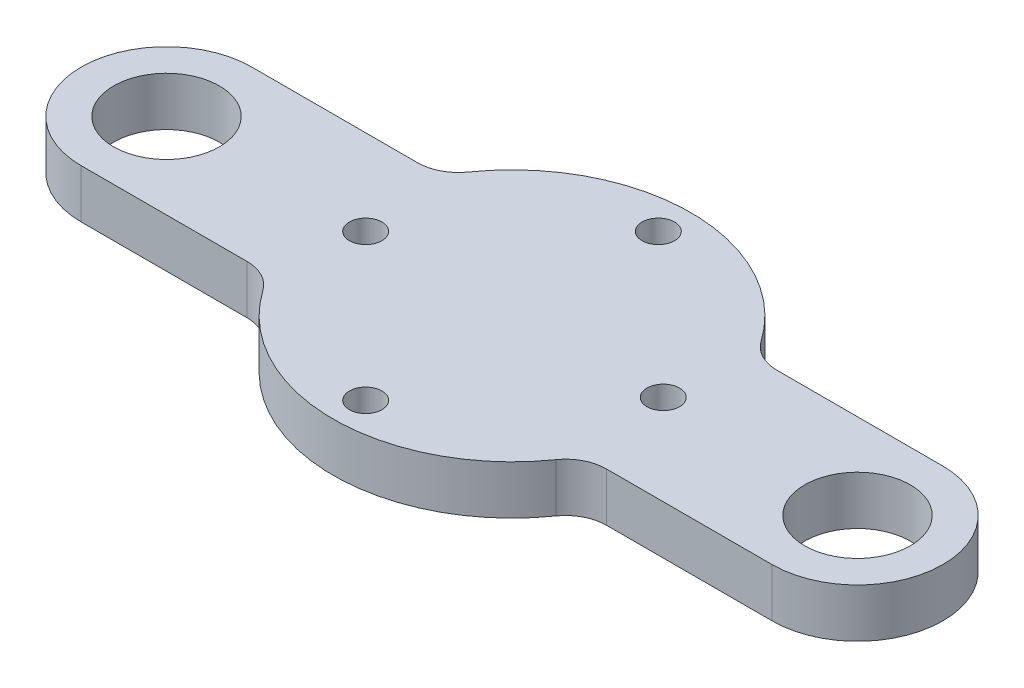
ISO-10303-21;
HEADER;
FILE_DESCRIPTION(('STEP AP214'),'2;1');
FILE_NAME('part.step','',(''),(''),'','','');
FILE_SCHEMA(('AUTOMOTIVE_DESIGN { 1 0 10303 214 1 1 1 1 }'));
ENDSEC;
DATA;
#1=APPLICATION_CONTEXT('core data for automotive mechanical design processes');
#2=APPLICATION_PROTOCOL_DEFINITION('international standard','automotive_design',2000,#1);
#3=PRODUCT_CONTEXT('',#1,'mechanical');
#4=PRODUCT('Part','Part','',(#3));
#5=PRODUCT_RELATED_PRODUCT_CATEGORY('part','',(#4));
#6=PRODUCT_DEFINITION_FORMATION('','',#4);
#7=PRODUCT_DEFINITION_CONTEXT('part definition',#1,'design');
#8=PRODUCT_DEFINITION('design','',#6,#7);
#9=PRODUCT_DEFINITION_SHAPE('','',#8);
#10=(LENGTH_UNIT() NAMED_UNIT(*) SI_UNIT(.MILLI.,.METRE.));
#11=(NAMED_UNIT(*) PLANE_ANGLE_UNIT() SI_UNIT($,.RADIAN.));
#12=(NAMED_UNIT(*) SI_UNIT($,.STERADIAN.) SOLID_ANGLE_UNIT());
#13=UNCERTAINTY_MEASURE_WITH_UNIT(LENGTH_MEASURE(1.E-05),#10,'distance_accuracy_value','');
#14=(GEOMETRIC_REPRESENTATION_CONTEXT(3) GLOBAL_UNCERTAINTY_ASSIGNED_CONTEXT((#13)) GLOBAL_UNIT_ASSIGNED_CONTEXT((#10,
#11,#12)) REPRESENTATION_CONTEXT('',''));
#15=CARTESIAN_POINT('',(0.,0.,0.));
#16=DIRECTION('',(0.,0.,1.));
#17=DIRECTION('',(1.,0.,0.));
#18=AXIS2_PLACEMENT_3D('',#15,#16,#17);
#19=CARTESIAN_POINT('',(0.,6.,10.5));
#20=DIRECTION('',(0.,0.,-1.));
#21=DIRECTION('',(-1.,0.,0.));
#22=AXIS2_PLACEMENT_3D('',#19,#20,#21);
#23=PLANE('',#22);
#24=DIRECTION('',(1.,0.,0.));
#25=VECTOR('',#24,1.);
#26=CARTESIAN_POINT('',(0.,0.,10.5));
#27=LINE('',#26,#25);
#28=CARTESIAN_POINT('',(22.1076909694341,0.,10.5));
#29=VERTEX_POINT('',#28);
#30=CARTESIAN_POINT('',(42.5,0.,10.5));
#31=VERTEX_POINT('',#30);
#32=EDGE_CURVE('E198',#29,#31,#27,.T.);
#33=ORIENTED_EDGE('',*,*,#32,.T.);
#34=DIRECTION('',(0.,-1.,0.));
#35=VECTOR('',#34,1.);
#36=CARTESIAN_POINT('',(42.5,6.,10.5));
#37=LINE('',#36,#35);
#38=CARTESIAN_POINT('',(42.5,6.,10.5));
#39=VERTEX_POINT('',#38);
#40=EDGE_CURVE('E11',#39,#31,#37,.T.);
#41=ORIENTED_EDGE('',*,*,#40,.F.);
#42=DIRECTION('',(1.,0.,0.));
#43=VECTOR('',#42,1.);
#44=CARTESIAN_POINT('',(0.,6.,10.5));
#45=LINE('',#44,#43);
#46=CARTESIAN_POINT('',(22.1076909694341,6.,10.5));
#47=VERTEX_POINT('',#46);
#48=EDGE_CURVE('E265',#47,#39,#45,.T.);
#49=ORIENTED_EDGE('',*,*,#48,.F.);
#50=DIRECTION('',(0.,-1.,0.));
#51=VECTOR('',#50,1.);
#52=CARTESIAN_POINT('',(22.1076909694341,6.,10.5));
#53=LINE('',#52,#51);
#54=EDGE_CURVE('E62',#47,#29,#53,.T.);
#55=ORIENTED_EDGE('',*,*,#54,.T.);
#56=EDGE_LOOP('',(#33,#41,#49,#55));
#57=FACE_BOUND('',#56,.T.);
#58=ADVANCED_FACE('F45',(#57),#23,.F.);
#59=CARTESIAN_POINT('',(42.5,6.,0.));
#60=DIRECTION('',(0.,-1.,0.));
#61=DIRECTION('',(0.,0.,-1.));
#62=AXIS2_PLACEMENT_3D('',#59,#60,#61);
#63=CYLINDRICAL_SURFACE('',#62,10.5);
#64=CARTESIAN_POINT('',(42.5,0.,0.));
#65=DIRECTION('',(0.,1.,0.));
#66=DIRECTION('',(0.,0.,1.));
#67=AXIS2_PLACEMENT_3D('',#64,#65,#66);
#68=CIRCLE('',#67,10.5);
#69=CARTESIAN_POINT('',(42.5,0.,-10.5));
#70=VERTEX_POINT('',#69);
#71=EDGE_CURVE('E201',#31,#70,#68,.T.);
#72=ORIENTED_EDGE('',*,*,#71,.T.);
#73=DIRECTION('',(0.,-1.,0.));
#74=VECTOR('',#73,1.);
#75=CARTESIAN_POINT('',(42.5,6.,-10.5));
#76=LINE('',#75,#74);
#77=CARTESIAN_POINT('',(42.5,6.,-10.5));
#78=VERTEX_POINT('',#77);
#79=EDGE_CURVE('E54',#78,#70,#76,.T.);
#80=ORIENTED_EDGE('',*,*,#79,.F.);
#81=CARTESIAN_POINT('',(42.5,6.,0.));
#82=DIRECTION('',(0.,1.,0.));
#83=DIRECTION('',(0.,0.,1.));
#84=AXIS2_PLACEMENT_3D('',#81,#82,#83);
#85=CIRCLE('',#84,10.5);
#86=EDGE_CURVE('E113',#39,#78,#85,.T.);
#87=ORIENTED_EDGE('',*,*,#86,.F.);
#88=ORIENTED_EDGE('',*,*,#40,.T.);
#89=EDGE_LOOP('',(#72,#80,#87,#88));
#90=FACE_BOUND('',#89,.T.);
#91=ADVANCED_FACE('F297',(#90),#63,.T.);
#92=CARTESIAN_POINT('',(0.,6.,-10.5));
#93=DIRECTION('',(0.,0.,-1.));
#94=DIRECTION('',(-1.,0.,0.));
#95=AXIS2_PLACEMENT_3D('',#92,#93,#94);
#96=PLANE('',#95);
#97=DIRECTION('',(1.,0.,0.));
#98=VECTOR('',#97,1.);
#99=CARTESIAN_POINT('',(0.,0.,-10.5));
#100=LINE('',#99,#98);
#101=CARTESIAN_POINT('',(22.1076909694341,0.,-10.5));
#102=VERTEX_POINT('',#101);
#103=EDGE_CURVE('E205',#102,#70,#100,.T.);
#104=ORIENTED_EDGE('',*,*,#103,.F.);
#105=DIRECTION('',(0.,-1.,0.));
#106=VECTOR('',#105,1.);
#107=CARTESIAN_POINT('',(22.1076909694341,6.,-10.5));
#108=LINE('',#107,#106);
#109=CARTESIAN_POINT('',(22.1076909694341,6.,-10.5));
#110=VERTEX_POINT('',#109);
#111=EDGE_CURVE('E288',#110,#102,#108,.T.);
#112=ORIENTED_EDGE('',*,*,#111,.F.);
#113=DIRECTION('',(1.,0.,0.));
#114=VECTOR('',#113,1.);
#115=CARTESIAN_POINT('',(0.,6.,-10.5));
#116=LINE('',#115,#114);
#117=EDGE_CURVE('E296',#110,#78,#116,.T.);
#118=ORIENTED_EDGE('',*,*,#117,.T.);
#119=ORIENTED_EDGE('',*,*,#79,.T.);
#120=EDGE_LOOP('',(#104,#112,#118,#119));
#121=FACE_BOUND('',#120,.T.);
#122=ADVANCED_FACE('F294',(#121),#96,.T.);
#123=CARTESIAN_POINT('',(22.1076909694341,6.,-15.5));
#124=DIRECTION('',(0.,-1.,0.));
#125=DIRECTION('',(0.,0.,-1.));
#126=AXIS2_PLACEMENT_3D('',#123,#124,#125);
#127=CYLINDRICAL_SURFACE('',#126,5.);
#128=CARTESIAN_POINT('',(22.1076909694341,0.,-15.5));
#129=DIRECTION('',(0.,1.,0.));
#130=DIRECTION('',(0.,0.,1.));
#131=AXIS2_PLACEMENT_3D('',#128,#129,#130);
#132=CIRCLE('',#131,5.);
#133=CARTESIAN_POINT('',(18.0136741232426,0.,-12.6296296296296));
#134=VERTEX_POINT('',#133);
#135=EDGE_CURVE('E209',#134,#102,#132,.T.);
#136=ORIENTED_EDGE('',*,*,#135,.F.);
#137=DIRECTION('',(0.,-1.,0.));
#138=VECTOR('',#137,1.);
#139=CARTESIAN_POINT('',(18.0136741232426,6.,-12.6296296296296));
#140=LINE('',#139,#138);
#141=CARTESIAN_POINT('',(18.0136741232426,6.,-12.6296296296296));
#142=VERTEX_POINT('',#141);
#143=EDGE_CURVE('E285',#142,#134,#140,.T.);
#144=ORIENTED_EDGE('',*,*,#143,.F.);
#145=CARTESIAN_POINT('',(22.1076909694341,6.,-15.5));
#146=DIRECTION('',(0.,1.,0.));
#147=DIRECTION('',(0.,0.,1.));
#148=AXIS2_PLACEMENT_3D('',#145,#146,#147);
#149=CIRCLE('',#148,5.);
#150=EDGE_CURVE('E309',#142,#110,#149,.T.);
#151=ORIENTED_EDGE('',*,*,#150,.T.);
#152=ORIENTED_EDGE('',*,*,#111,.T.);
#153=EDGE_LOOP('',(#136,#144,#151,#152));
#154=FACE_BOUND('',#153,.T.);
#155=ADVANCED_FACE('F305',(#154),#127,.F.);
#156=CARTESIAN_POINT('',(0.,6.,0.));
#157=DIRECTION('',(0.,-1.,0.));
#158=DIRECTION('',(0.,0.,-1.));
#159=AXIS2_PLACEMENT_3D('',#156,#157,#158);
#160=CYLINDRICAL_SURFACE('',#159,22.);
#161=CARTESIAN_POINT('',(0.,0.,0.));
#162=DIRECTION('',(0.,1.,0.));
#163=DIRECTION('',(0.,0.,1.));
#164=AXIS2_PLACEMENT_3D('',#161,#162,#163);
#165=CIRCLE('',#164,22.);
#166=CARTESIAN_POINT('',(-18.0136741232426,0.,-12.6296296296296));
#167=VERTEX_POINT('',#166);
#168=EDGE_CURVE('E213',#134,#167,#165,.T.);
#169=ORIENTED_EDGE('',*,*,#168,.T.);
#170=DIRECTION('',(0.,-1.,0.));
#171=VECTOR('',#170,1.);
#172=CARTESIAN_POINT('',(-18.0136741232426,6.,-12.6296296296296));
#173=LINE('',#172,#171);
#174=CARTESIAN_POINT('',(-18.0136741232426,6.,-12.6296296296296));
#175=VERTEX_POINT('',#174);
#176=EDGE_CURVE('E282',#175,#167,#173,.T.);
#177=ORIENTED_EDGE('',*,*,#176,.F.);
#178=CARTESIAN_POINT('',(0.,6.,0.));
#179=DIRECTION('',(0.,1.,0.));
#180=DIRECTION('',(0.,0.,1.));
#181=AXIS2_PLACEMENT_3D('',#178,#179,#180);
#182=CIRCLE('',#181,22.);
#183=EDGE_CURVE('E314',#142,#175,#182,.T.);
#184=ORIENTED_EDGE('',*,*,#183,.F.);
#185=ORIENTED_EDGE('',*,*,#143,.T.);
#186=EDGE_LOOP('',(#169,#177,#184,#185));
#187=FACE_BOUND('',#186,.T.);
#188=ADVANCED_FACE('F366',(#187),#160,.T.);
#189=CARTESIAN_POINT('',(-22.1076909694341,6.,-15.5));
#190=DIRECTION('',(0.,-1.,0.));
#191=DIRECTION('',(0.,0.,-1.));
#192=AXIS2_PLACEMENT_3D('',#189,#190,#191);
#193=CYLINDRICAL_SURFACE('',#192,5.);
#194=CARTESIAN_POINT('',(-22.1076909694341,0.,-15.5));
#195=DIRECTION('',(0.,1.,0.));
#196=DIRECTION('',(0.,0.,1.));
#197=AXIS2_PLACEMENT_3D('',#194,#195,#196);
#198=CIRCLE('',#197,5.);
#199=CARTESIAN_POINT('',(-22.1076909694341,0.,-10.5));
#200=VERTEX_POINT('',#199);
#201=EDGE_CURVE('E217',#200,#167,#198,.T.);
#202=ORIENTED_EDGE('',*,*,#201,.F.);
#203=DIRECTION('',(0.,-1.,0.));
#204=VECTOR('',#203,1.);
#205=CARTESIAN_POINT('',(-22.1076909694341,6.,-10.5));
#206=LINE('',#205,#204);
#207=CARTESIAN_POINT('',(-22.1076909694341,6.,-10.5));
#208=VERTEX_POINT('',#207);
#209=EDGE_CURVE('E279',#208,#200,#206,.T.);
#210=ORIENTED_EDGE('',*,*,#209,.F.);
#211=CARTESIAN_POINT('',(-22.1076909694341,6.,-15.5));
#212=DIRECTION('',(0.,1.,0.));
#213=DIRECTION('',(0.,0.,1.));
#214=AXIS2_PLACEMENT_3D('',#211,#212,#213);
#215=CIRCLE('',#214,5.);
#216=EDGE_CURVE('E321',#208,#175,#215,.T.);
#217=ORIENTED_EDGE('',*,*,#216,.T.);
#218=ORIENTED_EDGE('',*,*,#176,.T.);
#219=EDGE_LOOP('',(#202,#210,#217,#218));
#220=FACE_BOUND('',#219,.T.);
#221=ADVANCED_FACE('F369',(#220),#193,.F.);
#222=CARTESIAN_POINT('',(0.,6.,-10.5));
#223=DIRECTION('',(0.,0.,-1.));
#224=DIRECTION('',(-1.,0.,0.));
#225=AXIS2_PLACEMENT_3D('',#222,#223,#224);
#226=PLANE('',#225);
#227=DIRECTION('',(1.,0.,0.));
#228=VECTOR('',#227,1.);
#229=CARTESIAN_POINT('',(0.,0.,-10.5));
#230=LINE('',#229,#228);
#231=CARTESIAN_POINT('',(-42.5,0.,-10.5));
#232=VERTEX_POINT('',#231);
#233=EDGE_CURVE('E221',#232,#200,#230,.T.);
#234=ORIENTED_EDGE('',*,*,#233,.F.);
#235=DIRECTION('',(0.,-1.,0.));
#236=VECTOR('',#235,1.);
#237=CARTESIAN_POINT('',(-42.5,6.,-10.5));
#238=LINE('',#237,#236);
#239=CARTESIAN_POINT('',(-42.5,6.,-10.5));
#240=VERTEX_POINT('',#239);
#241=EDGE_CURVE('E276',#240,#232,#238,.T.);
#242=ORIENTED_EDGE('',*,*,#241,.F.);
#243=DIRECTION('',(1.,0.,0.));
#244=VECTOR('',#243,1.);
#245=CARTESIAN_POINT('',(0.,6.,-10.5));
#246=LINE('',#245,#244);
#247=EDGE_CURVE('E325',#240,#208,#246,.T.);
#248=ORIENTED_EDGE('',*,*,#247,.T.);
#249=ORIENTED_EDGE('',*,*,#209,.T.);
#250=EDGE_LOOP('',(#234,#242,#248,#249));
#251=FACE_BOUND('',#250,.T.);
#252=ADVANCED_FACE('F373',(#251),#226,.T.);
#253=CARTESIAN_POINT('',(-42.5,6.,0.));
#254=DIRECTION('',(0.,-1.,0.));
#255=DIRECTION('',(0.,0.,-1.));
#256=AXIS2_PLACEMENT_3D('',#253,#254,#255);
#257=CYLINDRICAL_SURFACE('',#256,10.5);
#258=CARTESIAN_POINT('',(-42.5,0.,0.));
#259=DIRECTION('',(0.,1.,0.));
#260=DIRECTION('',(0.,0.,1.));
#261=AXIS2_PLACEMENT_3D('',#258,#259,#260);
#262=CIRCLE('',#261,10.5);
#263=CARTESIAN_POINT('',(-42.5,0.,10.5));
#264=VERTEX_POINT('',#263);
#265=EDGE_CURVE('E225',#232,#264,#262,.T.);
#266=ORIENTED_EDGE('',*,*,#265,.T.);
#267=DIRECTION('',(0.,-1.,0.));
#268=VECTOR('',#267,1.);
#269=CARTESIAN_POINT('',(-42.5,6.,10.5));
#270=LINE('',#269,#268);
#271=CARTESIAN_POINT('',(-42.5,6.,10.5));
#272=VERTEX_POINT('',#271);
#273=EDGE_CURVE('E272',#272,#264,#270,.T.);
#274=ORIENTED_EDGE('',*,*,#273,.F.);
#275=CARTESIAN_POINT('',(-42.5,6.,0.));
#276=DIRECTION('',(0.,1.,0.));
#277=DIRECTION('',(0.,0.,1.));
#278=AXIS2_PLACEMENT_3D('',#275,#276,#277);
#279=CIRCLE('',#278,10.5);
#280=EDGE_CURVE('E168',#240,#272,#279,.T.);
#281=ORIENTED_EDGE('',*,*,#280,.F.);
#282=ORIENTED_EDGE('',*,*,#241,.T.);
#283=EDGE_LOOP('',(#266,#274,#281,#282));
#284=FACE_BOUND('',#283,.T.);
#285=ADVANCED_FACE('F334',(#284),#257,.T.);
#286=CARTESIAN_POINT('',(0.,6.,10.5));
#287=DIRECTION('',(0.,0.,-1.));
#288=DIRECTION('',(-1.,0.,0.));
#289=AXIS2_PLACEMENT_3D('',#286,#287,#288);
#290=PLANE('',#289);
#291=DIRECTION('',(1.,0.,0.));
#292=VECTOR('',#291,1.);
#293=CARTESIAN_POINT('',(0.,0.,10.5));
#294=LINE('',#293,#292);
#295=CARTESIAN_POINT('',(-22.1076909694341,0.,10.5));
#296=VERTEX_POINT('',#295);
#297=EDGE_CURVE('E228',#264,#296,#294,.T.);
#298=ORIENTED_EDGE('',*,*,#297,.T.);
#299=DIRECTION('',(0.,-1.,0.));
#300=VECTOR('',#299,1.);
#301=CARTESIAN_POINT('',(-22.1076909694341,6.,10.5));
#302=LINE('',#301,#300);
#303=CARTESIAN_POINT('',(-22.1076909694341,6.,10.5));
#304=VERTEX_POINT('',#303);
#305=EDGE_CURVE('E151',#304,#296,#302,.T.);
#306=ORIENTED_EDGE('',*,*,#305,.F.);
#307=DIRECTION('',(1.,0.,0.));
#308=VECTOR('',#307,1.);
#309=CARTESIAN_POINT('',(0.,6.,10.5));
#310=LINE('',#309,#308);
#311=EDGE_CURVE('E163',#272,#304,#310,.T.);
#312=ORIENTED_EDGE('',*,*,#311,.F.);
#313=ORIENTED_EDGE('',*,*,#273,.T.);
#314=EDGE_LOOP('',(#298,#306,#312,#313));
#315=FACE_BOUND('',#314,.T.);
#316=ADVANCED_FACE('F338',(#315),#290,.F.);
#317=CARTESIAN_POINT('',(-22.1076909694341,6.,15.5));
#318=DIRECTION('',(0.,-1.,0.));
#319=DIRECTION('',(0.,0.,-1.));
#320=AXIS2_PLACEMENT_3D('',#317,#318,#319);
#321=CYLINDRICAL_SURFACE('',#320,5.);
#322=CARTESIAN_POINT('',(-22.1076909694341,0.,15.5));
#323=DIRECTION('',(0.,1.,0.));
#324=DIRECTION('',(0.,0.,1.));
#325=AXIS2_PLACEMENT_3D('',#322,#323,#324);
#326=CIRCLE('',#325,5.);
#327=CARTESIAN_POINT('',(-18.0136741232426,0.,12.6296296296296));
#328=VERTEX_POINT('',#327);
#329=EDGE_CURVE('E147',#328,#296,#326,.T.);
#330=ORIENTED_EDGE('',*,*,#329,.F.);
#331=DIRECTION('',(0.,-1.,0.));
#332=VECTOR('',#331,1.);
#333=CARTESIAN_POINT('',(-18.0136741232426,6.,12.6296296296296));
#334=LINE('',#333,#332);
#335=CARTESIAN_POINT('',(-18.0136741232426,6.,12.6296296296296));
#336=VERTEX_POINT('',#335);
#337=EDGE_CURVE('E141',#336,#328,#334,.T.);
#338=ORIENTED_EDGE('',*,*,#337,.F.);
#339=CARTESIAN_POINT('',(-22.1076909694341,6.,15.5));
#340=DIRECTION('',(0.,1.,0.));
#341=DIRECTION('',(0.,0.,1.));
#342=AXIS2_PLACEMENT_3D('',#339,#340,#341);
#343=CIRCLE('',#342,5.);
#344=EDGE_CURVE('E145',#336,#304,#343,.T.);
#345=ORIENTED_EDGE('',*,*,#344,.T.);
#346=ORIENTED_EDGE('',*,*,#305,.T.);
#347=EDGE_LOOP('',(#330,#338,#345,#346));
#348=FACE_BOUND('',#347,.T.);
#349=ADVANCED_FACE('F143',(#348),#321,.F.);
#350=CARTESIAN_POINT('',(0.,6.,0.));
#351=DIRECTION('',(0.,-1.,0.));
#352=DIRECTION('',(0.,0.,-1.));
#353=AXIS2_PLACEMENT_3D('',#350,#351,#352);
#354=CYLINDRICAL_SURFACE('',#353,22.);
#355=CARTESIAN_POINT('',(0.,0.,0.));
#356=DIRECTION('',(0.,1.,0.));
#357=DIRECTION('',(0.,0.,1.));
#358=AXIS2_PLACEMENT_3D('',#355,#356,#357);
#359=CIRCLE('',#358,22.);
#360=CARTESIAN_POINT('',(18.0136741232426,0.,12.6296296296296));
#361=VERTEX_POINT('',#360);
#362=EDGE_CURVE('E234',#328,#361,#359,.T.);
#363=ORIENTED_EDGE('',*,*,#362,.T.);
#364=DIRECTION('',(0.,-1.,0.));
#365=VECTOR('',#364,1.);
#366=CARTESIAN_POINT('',(18.0136741232426,6.,12.6296296296296));
#367=LINE('',#366,#365);
#368=CARTESIAN_POINT('',(18.0136741232426,6.,12.6296296296296));
#369=VERTEX_POINT('',#368);
#370=EDGE_CURVE('E101',#369,#361,#367,.T.);
#371=ORIENTED_EDGE('',*,*,#370,.F.);
#372=CARTESIAN_POINT('',(0.,6.,0.));
#373=DIRECTION('',(0.,1.,0.));
#374=DIRECTION('',(0.,0.,1.));
#375=AXIS2_PLACEMENT_3D('',#372,#373,#374);
#376=CIRCLE('',#375,22.);
#377=EDGE_CURVE('E153',#336,#369,#376,.T.);
#378=ORIENTED_EDGE('',*,*,#377,.F.);
#379=ORIENTED_EDGE('',*,*,#337,.T.);
#380=EDGE_LOOP('',(#363,#371,#378,#379));
#381=FACE_BOUND('',#380,.T.);
#382=ADVANCED_FACE('F154',(#381),#354,.T.);
#383=CARTESIAN_POINT('',(-42.5,6.,0.));
#384=DIRECTION('',(0.,-1.,0.));
#385=DIRECTION('',(0.,0.,-1.));
#386=AXIS2_PLACEMENT_3D('',#383,#384,#385);
#387=CYLINDRICAL_SURFACE('',#386,6.5);
#388=CARTESIAN_POINT('',(-42.5,6.,0.));
#389=DIRECTION('',(0.,1.,0.));
#390=DIRECTION('',(0.,0.,1.));
#391=AXIS2_PLACEMENT_3D('',#388,#389,#390);
#392=CIRCLE('',#391,6.5);
#393=CARTESIAN_POINT('',(-42.5,6.,6.50000000000001));
#394=VERTEX_POINT('',#393);
#395=EDGE_CURVE('E190',#394,#394,#392,.T.);
#396=ORIENTED_EDGE('',*,*,#395,.T.);
#397=EDGE_LOOP('',(#396));
#398=FACE_BOUND('',#397,.T.);
#399=CARTESIAN_POINT('',(-42.5,0.,0.));
#400=DIRECTION('',(0.,1.,0.));
#401=DIRECTION('',(0.,0.,1.));
#402=AXIS2_PLACEMENT_3D('',#399,#400,#401);
#403=CIRCLE('',#402,6.5);
#404=CARTESIAN_POINT('',(-42.5,0.,6.50000000000001));
#405=VERTEX_POINT('',#404);
#406=EDGE_CURVE('E257',#405,#405,#403,.T.);
#407=ORIENTED_EDGE('',*,*,#406,.F.);
#408=EDGE_LOOP('',(#407));
#409=FACE_BOUND('',#408,.T.);
#410=ADVANCED_FACE('F384',(#398,#409),#387,.F.);
#411=CARTESIAN_POINT('',(0.,6.,-18.));
#412=DIRECTION('',(0.,-1.,0.));
#413=DIRECTION('',(0.,0.,-1.));
#414=AXIS2_PLACEMENT_3D('',#411,#412,#413);
#415=CYLINDRICAL_SURFACE('',#414,2.);
#416=CARTESIAN_POINT('',(0.,6.,-18.));
#417=DIRECTION('',(0.,1.,0.));
#418=DIRECTION('',(0.,0.,1.));
#419=AXIS2_PLACEMENT_3D('',#416,#417,#418);
#420=CIRCLE('',#419,2.);
#421=CARTESIAN_POINT('',(0.,6.,-16.));
#422=VERTEX_POINT('',#421);
#423=EDGE_CURVE('E186',#422,#422,#420,.T.);
#424=ORIENTED_EDGE('',*,*,#423,.T.);
#425=EDGE_LOOP('',(#424));
#426=FACE_BOUND('',#425,.T.);
#427=CARTESIAN_POINT('',(0.,0.,-18.));
#428=DIRECTION('',(0.,1.,0.));
#429=DIRECTION('',(0.,0.,1.));
#430=AXIS2_PLACEMENT_3D('',#427,#428,#429);
#431=CIRCLE('',#430,2.);
#432=CARTESIAN_POINT('',(0.,0.,-16.));
#433=VERTEX_POINT('',#432);
#434=EDGE_CURVE('E253',#433,#433,#431,.T.);
#435=ORIENTED_EDGE('',*,*,#434,.F.);
#436=EDGE_LOOP('',(#435));
#437=FACE_BOUND('',#436,.T.);
#438=ADVANCED_FACE('F388',(#426,#437),#415,.F.);
#439=CARTESIAN_POINT('',(-18.,6.,0.));
#440=DIRECTION('',(0.,-1.,0.));
#441=DIRECTION('',(0.,0.,-1.));
#442=AXIS2_PLACEMENT_3D('',#439,#440,#441);
#443=CYLINDRICAL_SURFACE('',#442,2.);
#444=CARTESIAN_POINT('',(-18.,6.,0.));
#445=DIRECTION('',(0.,1.,0.));
#446=DIRECTION('',(0.,0.,1.));
#447=AXIS2_PLACEMENT_3D('',#444,#445,#446);
#448=CIRCLE('',#447,2.);
#449=CARTESIAN_POINT('',(-18.,6.,2.));
#450=VERTEX_POINT('',#449);
#451=EDGE_CURVE('E182',#450,#450,#448,.T.);
#452=ORIENTED_EDGE('',*,*,#451,.T.);
#453=EDGE_LOOP('',(#452));
#454=FACE_BOUND('',#453,.T.);
#455=CARTESIAN_POINT('',(-18.,0.,0.));
#456=DIRECTION('',(0.,1.,0.));
#457=DIRECTION('',(0.,0.,1.));
#458=AXIS2_PLACEMENT_3D('',#455,#456,#457);
#459=CIRCLE('',#458,2.);
#460=CARTESIAN_POINT('',(-18.,0.,2.));
#461=VERTEX_POINT('',#460);
#462=EDGE_CURVE('E249',#461,#461,#459,.T.);
#463=ORIENTED_EDGE('',*,*,#462,.F.);
#464=EDGE_LOOP('',(#463));
#465=FACE_BOUND('',#464,.T.);
#466=ADVANCED_FACE('F394',(#454,#465),#443,.F.);
#467=CARTESIAN_POINT('',(0.,6.,18.));
#468=DIRECTION('',(0.,-1.,0.));
#469=DIRECTION('',(0.,0.,-1.));
#470=AXIS2_PLACEMENT_3D('',#467,#468,#469);
#471=CYLINDRICAL_SURFACE('',#470,2.);
#472=CARTESIAN_POINT('',(0.,6.,18.));
#473=DIRECTION('',(0.,1.,0.));
#474=DIRECTION('',(0.,0.,1.));
#475=AXIS2_PLACEMENT_3D('',#472,#473,#474);
#476=CIRCLE('',#475,2.);
#477=CARTESIAN_POINT('',(0.,6.,20.));
#478=VERTEX_POINT('',#477);
#479=EDGE_CURVE('E178',#478,#478,#476,.T.);
#480=ORIENTED_EDGE('',*,*,#479,.T.);
#481=EDGE_LOOP('',(#480));
#482=FACE_BOUND('',#481,.T.);
#483=CARTESIAN_POINT('',(0.,0.,18.));
#484=DIRECTION('',(0.,1.,0.));
#485=DIRECTION('',(0.,0.,1.));
#486=AXIS2_PLACEMENT_3D('',#483,#484,#485);
#487=CIRCLE('',#486,2.);
#488=CARTESIAN_POINT('',(0.,0.,20.));
#489=VERTEX_POINT('',#488);
#490=EDGE_CURVE('E245',#489,#489,#487,.T.);
#491=ORIENTED_EDGE('',*,*,#490,.F.);
#492=EDGE_LOOP('',(#491));
#493=FACE_BOUND('',#492,.T.);
#494=ADVANCED_FACE('F350',(#482,#493),#471,.F.);
#495=CARTESIAN_POINT('',(17.9893994874587,6.,-0.617661784977122));
#496=DIRECTION('',(0.,-1.,0.));
#497=DIRECTION('',(0.,0.,-1.));
#498=AXIS2_PLACEMENT_3D('',#495,#496,#497);
#499=CYLINDRICAL_SURFACE('',#498,2.);
#500=CARTESIAN_POINT('',(17.9893994874587,6.,-0.617661784977122));
#501=DIRECTION('',(0.,1.,0.));
#502=DIRECTION('',(0.,0.,1.));
#503=AXIS2_PLACEMENT_3D('',#500,#501,#502);
#504=CIRCLE('',#503,2.);
#505=CARTESIAN_POINT('',(17.9893994874587,6.,1.38233821502288));
#506=VERTEX_POINT('',#505);
#507=EDGE_CURVE('E174',#506,#506,#504,.T.);
#508=ORIENTED_EDGE('',*,*,#507,.T.);
#509=EDGE_LOOP('',(#508));
#510=FACE_BOUND('',#509,.T.);
#511=CARTESIAN_POINT('',(17.9893994874587,0.,-0.617661784977122));
#512=DIRECTION('',(0.,1.,0.));
#513=DIRECTION('',(0.,0.,1.));
#514=AXIS2_PLACEMENT_3D('',#511,#512,#513);
#515=CIRCLE('',#514,2.);
#516=CARTESIAN_POINT('',(17.9893994874587,0.,1.38233821502288));
#517=VERTEX_POINT('',#516);
#518=EDGE_CURVE('E241',#517,#517,#515,.T.);
#519=ORIENTED_EDGE('',*,*,#518,.F.);
#520=EDGE_LOOP('',(#519));
#521=FACE_BOUND('',#520,.T.);
#522=ADVANCED_FACE('F342',(#510,#521),#499,.F.);
#523=CARTESIAN_POINT('',(22.1076909694341,6.,15.5));
#524=DIRECTION('',(0.,-1.,0.));
#525=DIRECTION('',(0.,0.,-1.));
#526=AXIS2_PLACEMENT_3D('',#523,#524,#525);
#527=CYLINDRICAL_SURFACE('',#526,5.);
#528=CARTESIAN_POINT('',(22.1076909694341,0.,15.5));
#529=DIRECTION('',(0.,1.,0.));
#530=DIRECTION('',(0.,0.,1.));
#531=AXIS2_PLACEMENT_3D('',#528,#529,#530);
#532=CIRCLE('',#531,5.);
#533=EDGE_CURVE('E237',#29,#361,#532,.T.);
#534=ORIENTED_EDGE('',*,*,#533,.F.);
#535=ORIENTED_EDGE('',*,*,#54,.F.);
#536=CARTESIAN_POINT('',(22.1076909694341,6.,15.5));
#537=DIRECTION('',(0.,1.,0.));
#538=DIRECTION('',(0.,0.,1.));
#539=AXIS2_PLACEMENT_3D('',#536,#537,#538);
#540=CIRCLE('',#539,5.);
#541=EDGE_CURVE('E158',#47,#369,#540,.T.);
#542=ORIENTED_EDGE('',*,*,#541,.T.);
#543=ORIENTED_EDGE('',*,*,#370,.T.);
#544=EDGE_LOOP('',(#534,#535,#542,#543));
#545=FACE_BOUND('',#544,.T.);
#546=ADVANCED_FACE('F339',(#545),#527,.F.);
#547=CARTESIAN_POINT('',(42.5,6.,0.));
#548=DIRECTION('',(0.,-1.,0.));
#549=DIRECTION('',(0.,0.,-1.));
#550=AXIS2_PLACEMENT_3D('',#547,#548,#549);
#551=CYLINDRICAL_SURFACE('',#550,6.5);
#552=CARTESIAN_POINT('',(42.5,6.,0.));
#553=DIRECTION('',(0.,1.,0.));
#554=DIRECTION('',(0.,0.,1.));
#555=AXIS2_PLACEMENT_3D('',#552,#553,#554);
#556=CIRCLE('',#555,6.5);
#557=CARTESIAN_POINT('',(42.5,6.,6.5));
#558=VERTEX_POINT('',#557);
#559=EDGE_CURVE('E194',#558,#558,#556,.T.);
#560=ORIENTED_EDGE('',*,*,#559,.T.);
#561=EDGE_LOOP('',(#560));
#562=FACE_BOUND('',#561,.T.);
#563=CARTESIAN_POINT('',(42.5,0.,0.));
#564=DIRECTION('',(0.,1.,0.));
#565=DIRECTION('',(0.,0.,1.));
#566=AXIS2_PLACEMENT_3D('',#563,#564,#565);
#567=CIRCLE('',#566,6.5);
#568=CARTESIAN_POINT('',(42.5,0.,6.5));
#569=VERTEX_POINT('',#568);
#570=EDGE_CURVE('E261',#569,#569,#567,.T.);
#571=ORIENTED_EDGE('',*,*,#570,.F.);
#572=EDGE_LOOP('',(#571));
#573=FACE_BOUND('',#572,.T.);
#574=ADVANCED_FACE('F341',(#562,#573),#551,.F.);
#575=CARTESIAN_POINT('',(0.,6.,0.));
#576=DIRECTION('',(0.,1.,0.));
#577=DIRECTION('',(0.,0.,1.));
#578=AXIS2_PLACEMENT_3D('',#575,#576,#577);
#579=PLANE('',#578);
#580=ORIENTED_EDGE('',*,*,#48,.T.);
#581=ORIENTED_EDGE('',*,*,#86,.T.);
#582=ORIENTED_EDGE('',*,*,#117,.F.);
#583=ORIENTED_EDGE('',*,*,#150,.F.);
#584=ORIENTED_EDGE('',*,*,#183,.T.);
#585=ORIENTED_EDGE('',*,*,#216,.F.);
#586=ORIENTED_EDGE('',*,*,#247,.F.);
#587=ORIENTED_EDGE('',*,*,#280,.T.);
#588=ORIENTED_EDGE('',*,*,#311,.T.);
#589=ORIENTED_EDGE('',*,*,#344,.F.);
#590=ORIENTED_EDGE('',*,*,#377,.T.);
#591=ORIENTED_EDGE('',*,*,#541,.F.);
#592=EDGE_LOOP('',(#580,#581,#582,#583,#584,#585,#586,#587,#588,#589,#590,#591));
#593=FACE_BOUND('',#592,.T.);
#594=ORIENTED_EDGE('',*,*,#507,.F.);
#595=EDGE_LOOP('',(#594));
#596=FACE_BOUND('',#595,.T.);
#597=ORIENTED_EDGE('',*,*,#479,.F.);
#598=EDGE_LOOP('',(#597));
#599=FACE_BOUND('',#598,.T.);
#600=ORIENTED_EDGE('',*,*,#451,.F.);
#601=EDGE_LOOP('',(#600));
#602=FACE_BOUND('',#601,.T.);
#603=ORIENTED_EDGE('',*,*,#423,.F.);
#604=EDGE_LOOP('',(#603));
#605=FACE_BOUND('',#604,.T.);
#606=ORIENTED_EDGE('',*,*,#395,.F.);
#607=EDGE_LOOP('',(#606));
#608=FACE_BOUND('',#607,.T.);
#609=ORIENTED_EDGE('',*,*,#559,.F.);
#610=EDGE_LOOP('',(#609));
#611=FACE_BOUND('',#610,.T.);
#612=ADVANCED_FACE('F160',(#593,#596,#599,#602,#605,#608,#611),#579,.T.);
#613=CARTESIAN_POINT('',(0.,0.,0.));
#614=DIRECTION('',(0.,1.,0.));
#615=DIRECTION('',(0.,0.,1.));
#616=AXIS2_PLACEMENT_3D('',#613,#614,#615);
#617=PLANE('',#616);
#618=ORIENTED_EDGE('',*,*,#32,.F.);
#619=ORIENTED_EDGE('',*,*,#533,.T.);
#620=ORIENTED_EDGE('',*,*,#362,.F.);
#621=ORIENTED_EDGE('',*,*,#329,.T.);
#622=ORIENTED_EDGE('',*,*,#297,.F.);
#623=ORIENTED_EDGE('',*,*,#265,.F.);
#624=ORIENTED_EDGE('',*,*,#233,.T.);
#625=ORIENTED_EDGE('',*,*,#201,.T.);
#626=ORIENTED_EDGE('',*,*,#168,.F.);
#627=ORIENTED_EDGE('',*,*,#135,.T.);
#628=ORIENTED_EDGE('',*,*,#103,.T.);
#629=ORIENTED_EDGE('',*,*,#71,.F.);
#630=EDGE_LOOP('',(#618,#619,#620,#621,#622,#623,#624,#625,#626,#627,#628,#629));
#631=FACE_BOUND('',#630,.T.);
#632=ORIENTED_EDGE('',*,*,#518,.T.);
#633=EDGE_LOOP('',(#632));
#634=FACE_BOUND('',#633,.T.);
#635=ORIENTED_EDGE('',*,*,#490,.T.);
#636=EDGE_LOOP('',(#635));
#637=FACE_BOUND('',#636,.T.);
#638=ORIENTED_EDGE('',*,*,#462,.T.);
#639=EDGE_LOOP('',(#638));
#640=FACE_BOUND('',#639,.T.);
#641=ORIENTED_EDGE('',*,*,#434,.T.);
#642=EDGE_LOOP('',(#641));
#643=FACE_BOUND('',#642,.T.);
#644=ORIENTED_EDGE('',*,*,#406,.T.);
#645=EDGE_LOOP('',(#644));
#646=FACE_BOUND('',#645,.T.);
#647=ORIENTED_EDGE('',*,*,#570,.T.);
#648=EDGE_LOOP('',(#647));
#649=FACE_BOUND('',#648,.T.);
#650=ADVANCED_FACE('F300',(#631,#634,#637,#640,#643,#646,#649),#617,.F.);
#651=CLOSED_SHELL('',(#58,#91,#122,#155,#188,#221,#252,#285,#316,#349,#382,#410,#438,#466,#494,
#522,#546,#574,#612,#650));
#652=MANIFOLD_SOLID_BREP('B2',#651);
#653=ADVANCED_BREP_SHAPE_REPRESENTATION('',(#18,#652),#14);
#654=SHAPE_DEFINITION_REPRESENTATION(#9,#653);
ENDSEC;
END-ISO-10303-21;
